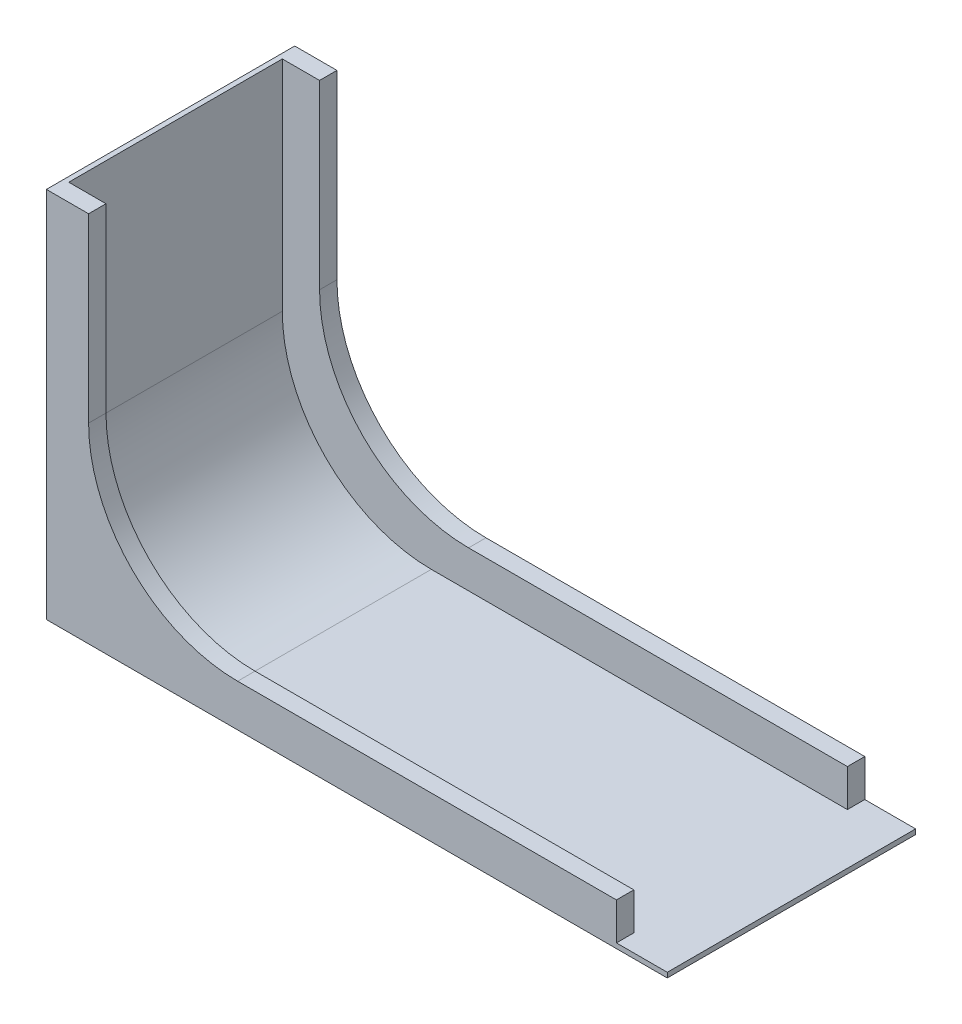
ISO-10303-21;
HEADER;
FILE_DESCRIPTION(('STEP AP214'),'2;1');
FILE_NAME('part.step','',(''),(''),'','','');
FILE_SCHEMA(('AUTOMOTIVE_DESIGN { 1 0 10303 214 1 1 1 1 }'));
ENDSEC;
DATA;
#1=APPLICATION_CONTEXT('core data for automotive mechanical design processes');
#2=APPLICATION_PROTOCOL_DEFINITION('international standard','automotive_design',2000,#1);
#3=PRODUCT_CONTEXT('',#1,'mechanical');
#4=PRODUCT('Part','Part','',(#3));
#5=PRODUCT_RELATED_PRODUCT_CATEGORY('part','',(#4));
#6=PRODUCT_DEFINITION_FORMATION('','',#4);
#7=PRODUCT_DEFINITION_CONTEXT('part definition',#1,'design');
#8=PRODUCT_DEFINITION('design','',#6,#7);
#9=PRODUCT_DEFINITION_SHAPE('','',#8);
#10=(LENGTH_UNIT() NAMED_UNIT(*) SI_UNIT(.MILLI.,.METRE.));
#11=(NAMED_UNIT(*) PLANE_ANGLE_UNIT() SI_UNIT($,.RADIAN.));
#12=(NAMED_UNIT(*) SI_UNIT($,.STERADIAN.) SOLID_ANGLE_UNIT());
#13=UNCERTAINTY_MEASURE_WITH_UNIT(LENGTH_MEASURE(1.E-05),#10,'distance_accuracy_value','');
#14=(GEOMETRIC_REPRESENTATION_CONTEXT(3) GLOBAL_UNCERTAINTY_ASSIGNED_CONTEXT((#13)) GLOBAL_UNIT_ASSIGNED_CONTEXT((#10,
#11,#12)) REPRESENTATION_CONTEXT('',''));
#15=CARTESIAN_POINT('',(0.,0.,0.));
#16=DIRECTION('',(0.,0.,1.));
#17=DIRECTION('',(1.,0.,0.));
#18=AXIS2_PLACEMENT_3D('',#15,#16,#17);
#19=CARTESIAN_POINT('',(-48.2323156450782,148.896265560166,100.));
#20=DIRECTION('',(-1.,0.,0.));
#21=DIRECTION('',(0.,0.,1.));
#22=AXIS2_PLACEMENT_3D('',#19,#20,#21);
#23=PLANE('',#22);
#24=DIRECTION('',(0.,-1.,0.));
#25=VECTOR('',#24,1.);
#26=CARTESIAN_POINT('',(-48.2323156450782,15.896265560166,93.));
#27=LINE('',#26,#25);
#28=CARTESIAN_POINT('',(-48.2323156450782,148.896265560166,93.));
#29=VERTEX_POINT('',#28);
#30=CARTESIAN_POINT('',(-48.2323156450782,60.896265560166,93.));
#31=VERTEX_POINT('',#30);
#32=EDGE_CURVE('E327',#29,#31,#27,.T.);
#33=ORIENTED_EDGE('',*,*,#32,.T.);
#34=DIRECTION('',(0.,0.,-1.));
#35=VECTOR('',#34,1.);
#36=CARTESIAN_POINT('',(-48.2323156450782,60.896265560166,7.00000000000002));
#37=LINE('',#36,#35);
#38=CARTESIAN_POINT('',(-48.2323156450782,60.896265560166,7.00000000000002));
#39=VERTEX_POINT('',#38);
#40=EDGE_CURVE('E167',#31,#39,#37,.T.);
#41=ORIENTED_EDGE('',*,*,#40,.T.);
#42=DIRECTION('',(0.,-1.,0.));
#43=VECTOR('',#42,1.);
#44=CARTESIAN_POINT('',(-48.2323156450782,15.896265560166,7.00000000000002));
#45=LINE('',#44,#43);
#46=CARTESIAN_POINT('',(-48.2323156450782,148.896265560166,7.));
#47=VERTEX_POINT('',#46);
#48=EDGE_CURVE('E160',#47,#39,#45,.T.);
#49=ORIENTED_EDGE('',*,*,#48,.F.);
#50=DIRECTION('',(0.,0.,-1.));
#51=VECTOR('',#50,1.);
#52=CARTESIAN_POINT('',(-48.2323156450782,148.896265560166,100.));
#53=LINE('',#52,#51);
#54=EDGE_CURVE('E164',#29,#47,#53,.T.);
#55=ORIENTED_EDGE('',*,*,#54,.F.);
#56=EDGE_LOOP('',(#33,#41,#49,#55));
#57=FACE_BOUND('',#56,.T.);
#58=ADVANCED_FACE('F41',(#57),#23,.F.);
#59=CARTESIAN_POINT('',(0.,15.896265560166,0.));
#60=DIRECTION('',(0.,1.,0.));
#61=DIRECTION('',(0.,0.,1.));
#62=AXIS2_PLACEMENT_3D('',#59,#60,#61);
#63=PLANE('',#62);
#64=DIRECTION('',(-1.,0.,0.));
#65=VECTOR('',#64,1.);
#66=CARTESIAN_POINT('',(0.,15.896265560166,0.));
#67=LINE('',#66,#65);
#68=CARTESIAN_POINT('',(179.294223463213,15.896265560166,0.));
#69=VERTEX_POINT('',#68);
#70=CARTESIAN_POINT('',(26.7676843549218,15.896265560166,0.));
#71=VERTEX_POINT('',#70);
#72=EDGE_CURVE('E229',#69,#71,#67,.T.);
#73=ORIENTED_EDGE('',*,*,#72,.T.);
#74=DIRECTION('',(0.,0.,-1.));
#75=VECTOR('',#74,1.);
#76=CARTESIAN_POINT('',(26.7676843549218,15.896265560166,0.));
#77=LINE('',#76,#75);
#78=CARTESIAN_POINT('',(26.7676843549218,15.896265560166,7.00000000000002));
#79=VERTEX_POINT('',#78);
#80=EDGE_CURVE('E199',#71,#79,#77,.F.);
#81=ORIENTED_EDGE('',*,*,#80,.T.);
#82=DIRECTION('',(-1.,0.,0.));
#83=VECTOR('',#82,1.);
#84=CARTESIAN_POINT('',(0.,15.896265560166,7.00000000000003));
#85=LINE('',#84,#83);
#86=CARTESIAN_POINT('',(179.294223463213,15.896265560166,7.));
#87=VERTEX_POINT('',#86);
#88=EDGE_CURVE('E213',#87,#79,#85,.T.);
#89=ORIENTED_EDGE('',*,*,#88,.F.);
#90=DIRECTION('',(0.,0.,1.));
#91=VECTOR('',#90,1.);
#92=CARTESIAN_POINT('',(179.294223463213,15.896265560166,0.));
#93=LINE('',#92,#91);
#94=EDGE_CURVE('E235',#69,#87,#93,.T.);
#95=ORIENTED_EDGE('',*,*,#94,.F.);
#96=EDGE_LOOP('',(#73,#81,#89,#95));
#97=FACE_BOUND('',#96,.T.);
#98=ADVANCED_FACE('F233',(#97),#63,.T.);
#99=CARTESIAN_POINT('',(-50.2323156450782,148.896265560166,100.));
#100=DIRECTION('',(0.,-1.,0.));
#101=DIRECTION('',(0.,0.,-1.));
#102=AXIS2_PLACEMENT_3D('',#99,#100,#101);
#103=PLANE('',#102);
#104=DIRECTION('',(-1.,0.,0.));
#105=VECTOR('',#104,1.);
#106=CARTESIAN_POINT('',(-50.2323156450782,148.896265560166,0.));
#107=LINE('',#106,#105);
#108=CARTESIAN_POINT('',(-33.2323156450782,148.896265560166,0.));
#109=VERTEX_POINT('',#108);
#110=CARTESIAN_POINT('',(-50.2323156450782,148.896265560166,0.));
#111=VERTEX_POINT('',#110);
#112=EDGE_CURVE('E249',#109,#111,#107,.T.);
#113=ORIENTED_EDGE('',*,*,#112,.T.);
#114=DIRECTION('',(0.,0.,-1.));
#115=VECTOR('',#114,1.);
#116=CARTESIAN_POINT('',(-50.2323156450782,148.896265560166,100.));
#117=LINE('',#116,#115);
#118=CARTESIAN_POINT('',(-50.2323156450782,148.896265560166,100.));
#119=VERTEX_POINT('',#118);
#120=EDGE_CURVE('E185',#119,#111,#117,.T.);
#121=ORIENTED_EDGE('',*,*,#120,.F.);
#122=DIRECTION('',(-1.,0.,0.));
#123=VECTOR('',#122,1.);
#124=CARTESIAN_POINT('',(-50.2323156450782,148.896265560166,100.));
#125=LINE('',#124,#123);
#126=CARTESIAN_POINT('',(-33.2323156450782,148.896265560166,100.));
#127=VERTEX_POINT('',#126);
#128=EDGE_CURVE('E253',#127,#119,#125,.T.);
#129=ORIENTED_EDGE('',*,*,#128,.F.);
#130=DIRECTION('',(0.,0.,1.));
#131=VECTOR('',#130,1.);
#132=CARTESIAN_POINT('',(-33.2323156450782,148.896265560166,100.));
#133=LINE('',#132,#131);
#134=CARTESIAN_POINT('',(-33.2323156450782,148.896265560166,93.));
#135=VERTEX_POINT('',#134);
#136=EDGE_CURVE('E311',#135,#127,#133,.T.);
#137=ORIENTED_EDGE('',*,*,#136,.F.);
#138=DIRECTION('',(-1.,0.,0.));
#139=VECTOR('',#138,1.);
#140=CARTESIAN_POINT('',(-33.2323156450782,148.896265560166,93.));
#141=LINE('',#140,#139);
#142=EDGE_CURVE('E183',#135,#29,#141,.T.);
#143=ORIENTED_EDGE('',*,*,#142,.T.);
#144=ORIENTED_EDGE('',*,*,#54,.T.);
#145=DIRECTION('',(-1.,0.,0.));
#146=VECTOR('',#145,1.);
#147=CARTESIAN_POINT('',(-33.2323156450782,148.896265560166,7.));
#148=LINE('',#147,#146);
#149=CARTESIAN_POINT('',(-33.2323156450782,148.896265560166,7.));
#150=VERTEX_POINT('',#149);
#151=EDGE_CURVE('E173',#150,#47,#148,.T.);
#152=ORIENTED_EDGE('',*,*,#151,.F.);
#153=DIRECTION('',(0.,0.,1.));
#154=VECTOR('',#153,1.);
#155=CARTESIAN_POINT('',(-33.2323156450782,148.896265560166,0.));
#156=LINE('',#155,#154);
#157=EDGE_CURVE('E220',#109,#150,#156,.T.);
#158=ORIENTED_EDGE('',*,*,#157,.F.);
#159=EDGE_LOOP('',(#113,#121,#129,#137,#143,#144,#152,#158));
#160=FACE_BOUND('',#159,.T.);
#161=ADVANCED_FACE('F180',(#160),#103,.F.);
#162=CARTESIAN_POINT('',(-50.2323156450782,-1.10373443983403,100.));
#163=DIRECTION('',(1.,0.,0.));
#164=DIRECTION('',(0.,0.,-1.));
#165=AXIS2_PLACEMENT_3D('',#162,#163,#164);
#166=PLANE('',#165);
#167=DIRECTION('',(0.,-1.,0.));
#168=VECTOR('',#167,1.);
#169=CARTESIAN_POINT('',(-50.2323156450782,-1.10373443983403,0.));
#170=LINE('',#169,#168);
#171=CARTESIAN_POINT('',(-50.2323156450782,-1.10373443983403,0.));
#172=VERTEX_POINT('',#171);
#173=EDGE_CURVE('E265',#111,#172,#170,.T.);
#174=ORIENTED_EDGE('',*,*,#173,.T.);
#175=DIRECTION('',(0.,0.,-1.));
#176=VECTOR('',#175,1.);
#177=CARTESIAN_POINT('',(-50.2323156450782,-1.10373443983403,100.));
#178=LINE('',#177,#176);
#179=CARTESIAN_POINT('',(-50.2323156450782,-1.10373443983403,100.));
#180=VERTEX_POINT('',#179);
#181=EDGE_CURVE('E191',#180,#172,#178,.T.);
#182=ORIENTED_EDGE('',*,*,#181,.F.);
#183=DIRECTION('',(0.,-1.,0.));
#184=VECTOR('',#183,1.);
#185=CARTESIAN_POINT('',(-50.2323156450782,-1.10373443983403,100.));
#186=LINE('',#185,#184);
#187=EDGE_CURVE('E256',#119,#180,#186,.T.);
#188=ORIENTED_EDGE('',*,*,#187,.F.);
#189=ORIENTED_EDGE('',*,*,#120,.T.);
#190=EDGE_LOOP('',(#174,#182,#188,#189));
#191=FACE_BOUND('',#190,.T.);
#192=ADVANCED_FACE('F285',(#191),#166,.F.);
#193=CARTESIAN_POINT('',(-0.232315645078182,-1.10373443983402,100.));
#194=DIRECTION('',(0.,1.,0.));
#195=DIRECTION('',(0.,0.,1.));
#196=AXIS2_PLACEMENT_3D('',#193,#194,#195);
#197=PLANE('',#196);
#198=DIRECTION('',(1.,0.,0.));
#199=VECTOR('',#198,1.);
#200=CARTESIAN_POINT('',(-0.232315645078182,-1.10373443983402,0.));
#201=LINE('',#200,#199);
#202=CARTESIAN_POINT('',(199.767684354922,-1.10373443983402,0.));
#203=VERTEX_POINT('',#202);
#204=EDGE_CURVE('E268',#172,#203,#201,.T.);
#205=ORIENTED_EDGE('',*,*,#204,.T.);
#206=DIRECTION('',(0.,0.,-1.));
#207=VECTOR('',#206,1.);
#208=CARTESIAN_POINT('',(199.767684354922,-1.10373443983402,100.));
#209=LINE('',#208,#207);
#210=CARTESIAN_POINT('',(199.767684354922,-1.10373443983402,100.));
#211=VERTEX_POINT('',#210);
#212=EDGE_CURVE('E275',#211,#203,#209,.T.);
#213=ORIENTED_EDGE('',*,*,#212,.F.);
#214=DIRECTION('',(1.,0.,0.));
#215=VECTOR('',#214,1.);
#216=CARTESIAN_POINT('',(-0.232315645078182,-1.10373443983402,100.));
#217=LINE('',#216,#215);
#218=EDGE_CURVE('E258',#180,#211,#217,.T.);
#219=ORIENTED_EDGE('',*,*,#218,.F.);
#220=ORIENTED_EDGE('',*,*,#181,.T.);
#221=EDGE_LOOP('',(#205,#213,#219,#220));
#222=FACE_BOUND('',#221,.T.);
#223=ADVANCED_FACE('F281',(#222),#197,.F.);
#224=CARTESIAN_POINT('',(199.767684354922,0.896265560165975,100.));
#225=DIRECTION('',(-1.,0.,0.));
#226=DIRECTION('',(0.,0.,1.));
#227=AXIS2_PLACEMENT_3D('',#224,#225,#226);
#228=PLANE('',#227);
#229=DIRECTION('',(0.,1.,0.));
#230=VECTOR('',#229,1.);
#231=CARTESIAN_POINT('',(199.767684354922,0.896265560165975,0.));
#232=LINE('',#231,#230);
#233=CARTESIAN_POINT('',(199.767684354922,0.896265560165975,0.));
#234=VERTEX_POINT('',#233);
#235=EDGE_CURVE('E270',#203,#234,#232,.T.);
#236=ORIENTED_EDGE('',*,*,#235,.T.);
#237=DIRECTION('',(0.,0.,-1.));
#238=VECTOR('',#237,1.);
#239=CARTESIAN_POINT('',(199.767684354922,0.896265560165975,100.));
#240=LINE('',#239,#238);
#241=CARTESIAN_POINT('',(199.767684354922,0.896265560165975,100.));
#242=VERTEX_POINT('',#241);
#243=EDGE_CURVE('E263',#242,#234,#240,.T.);
#244=ORIENTED_EDGE('',*,*,#243,.F.);
#245=DIRECTION('',(0.,1.,0.));
#246=VECTOR('',#245,1.);
#247=CARTESIAN_POINT('',(199.767684354922,0.896265560165975,100.));
#248=LINE('',#247,#246);
#249=EDGE_CURVE('E260',#211,#242,#248,.T.);
#250=ORIENTED_EDGE('',*,*,#249,.F.);
#251=ORIENTED_EDGE('',*,*,#212,.T.);
#252=EDGE_LOOP('',(#236,#244,#250,#251));
#253=FACE_BOUND('',#252,.T.);
#254=ADVANCED_FACE('F292',(#253),#228,.F.);
#255=CARTESIAN_POINT('',(-0.232315645078196,0.896265560165975,100.));
#256=DIRECTION('',(0.,-1.,0.));
#257=DIRECTION('',(0.,0.,-1.));
#258=AXIS2_PLACEMENT_3D('',#255,#256,#257);
#259=PLANE('',#258);
#260=DIRECTION('',(-1.,0.,0.));
#261=VECTOR('',#260,1.);
#262=CARTESIAN_POINT('',(0.,0.896265560165975,7.00000000000003));
#263=LINE('',#262,#261);
#264=CARTESIAN_POINT('',(179.294223463213,0.896265560165975,7.00000000000001));
#265=VERTEX_POINT('',#264);
#266=CARTESIAN_POINT('',(11.7676843549218,0.896265560165975,7.00000000000002));
#267=VERTEX_POINT('',#266);
#268=EDGE_CURVE('E238',#265,#267,#263,.T.);
#269=ORIENTED_EDGE('',*,*,#268,.T.);
#270=DIRECTION('',(0.,0.,-1.));
#271=VECTOR('',#270,1.);
#272=CARTESIAN_POINT('',(11.7676843549218,0.896265560165975,93.));
#273=LINE('',#272,#271);
#274=CARTESIAN_POINT('',(11.7676843549218,0.896265560165975,93.));
#275=VERTEX_POINT('',#274);
#276=EDGE_CURVE('E62',#267,#275,#273,.F.);
#277=ORIENTED_EDGE('',*,*,#276,.T.);
#278=DIRECTION('',(-1.,0.,0.));
#279=VECTOR('',#278,1.);
#280=CARTESIAN_POINT('',(0.,0.896265560165975,93.));
#281=LINE('',#280,#279);
#282=CARTESIAN_POINT('',(179.294223463213,0.896265560165975,93.));
#283=VERTEX_POINT('',#282);
#284=EDGE_CURVE('E318',#283,#275,#281,.T.);
#285=ORIENTED_EDGE('',*,*,#284,.F.);
#286=DIRECTION('',(0.,0.,1.));
#287=VECTOR('',#286,1.);
#288=CARTESIAN_POINT('',(179.294223463213,0.896265560165975,0.));
#289=LINE('',#288,#287);
#290=CARTESIAN_POINT('',(179.294223463213,0.896265560165975,100.));
#291=VERTEX_POINT('',#290);
#292=EDGE_CURVE('E297',#283,#291,#289,.T.);
#293=ORIENTED_EDGE('',*,*,#292,.T.);
#294=DIRECTION('',(-1.,0.,0.));
#295=VECTOR('',#294,1.);
#296=CARTESIAN_POINT('',(-3.2937496879602,0.896265560165975,100.));
#297=LINE('',#296,#295);
#298=EDGE_CURVE('E250',#242,#291,#297,.T.);
#299=ORIENTED_EDGE('',*,*,#298,.F.);
#300=ORIENTED_EDGE('',*,*,#243,.T.);
#301=DIRECTION('',(-1.,0.,0.));
#302=VECTOR('',#301,1.);
#303=CARTESIAN_POINT('',(-0.232315645078196,0.896265560165975,0.));
#304=LINE('',#303,#302);
#305=CARTESIAN_POINT('',(179.294223463213,0.896265560165975,0.));
#306=VERTEX_POINT('',#305);
#307=EDGE_CURVE('E254',#234,#306,#304,.T.);
#308=ORIENTED_EDGE('',*,*,#307,.T.);
#309=DIRECTION('',(0.,0.,1.));
#310=VECTOR('',#309,1.);
#311=CARTESIAN_POINT('',(179.294223463213,0.896265560165975,0.));
#312=LINE('',#311,#310);
#313=EDGE_CURVE('E242',#306,#265,#312,.T.);
#314=ORIENTED_EDGE('',*,*,#313,.T.);
#315=EDGE_LOOP('',(#269,#277,#285,#293,#299,#300,#308,#314));
#316=FACE_BOUND('',#315,.T.);
#317=ADVANCED_FACE('F294',(#316),#259,.F.);
#318=CARTESIAN_POINT('',(0.,0.,100.));
#319=DIRECTION('',(0.,0.,-1.));
#320=DIRECTION('',(-1.,0.,0.));
#321=AXIS2_PLACEMENT_3D('',#318,#319,#320);
#322=PLANE('',#321);
#323=DIRECTION('',(0.,-1.,0.));
#324=VECTOR('',#323,1.);
#325=CARTESIAN_POINT('',(-33.2323156450782,148.896265560166,100.));
#326=LINE('',#325,#324);
#327=CARTESIAN_POINT('',(-33.2323156450782,75.896265560166,100.));
#328=VERTEX_POINT('',#327);
#329=EDGE_CURVE('E303',#127,#328,#326,.T.);
#330=ORIENTED_EDGE('',*,*,#329,.F.);
#331=ORIENTED_EDGE('',*,*,#128,.T.);
#332=ORIENTED_EDGE('',*,*,#187,.T.);
#333=ORIENTED_EDGE('',*,*,#218,.T.);
#334=ORIENTED_EDGE('',*,*,#249,.T.);
#335=ORIENTED_EDGE('',*,*,#298,.T.);
#336=DIRECTION('',(0.,-1.,0.));
#337=VECTOR('',#336,1.);
#338=CARTESIAN_POINT('',(179.294223463213,15.896265560166,100.));
#339=LINE('',#338,#337);
#340=CARTESIAN_POINT('',(179.294223463213,15.896265560166,100.));
#341=VERTEX_POINT('',#340);
#342=EDGE_CURVE('E323',#341,#291,#339,.T.);
#343=ORIENTED_EDGE('',*,*,#342,.F.);
#344=DIRECTION('',(1.,0.,0.));
#345=VECTOR('',#344,1.);
#346=CARTESIAN_POINT('',(0.,15.896265560166,100.));
#347=LINE('',#346,#345);
#348=CARTESIAN_POINT('',(26.7676843549218,15.896265560166,100.));
#349=VERTEX_POINT('',#348);
#350=EDGE_CURVE('E321',#349,#341,#347,.T.);
#351=ORIENTED_EDGE('',*,*,#350,.F.);
#352=CARTESIAN_POINT('',(26.7676843549218,75.896265560166,100.));
#353=DIRECTION('',(0.,0.,-1.));
#354=DIRECTION('',(-1.,0.,0.));
#355=AXIS2_PLACEMENT_3D('',#352,#353,#354);
#356=CIRCLE('',#355,60.);
#357=EDGE_CURVE('E205',#349,#328,#356,.T.);
#358=ORIENTED_EDGE('',*,*,#357,.T.);
#359=EDGE_LOOP('',(#330,#331,#332,#333,#334,#335,#343,#351,#358));
#360=FACE_BOUND('',#359,.T.);
#361=ADVANCED_FACE('F301',(#360),#322,.F.);
#362=CARTESIAN_POINT('',(0.,0.,0.));
#363=DIRECTION('',(0.,0.,-1.));
#364=DIRECTION('',(-1.,0.,0.));
#365=AXIS2_PLACEMENT_3D('',#362,#363,#364);
#366=PLANE('',#365);
#367=ORIENTED_EDGE('',*,*,#112,.F.);
#368=DIRECTION('',(0.,1.,0.));
#369=VECTOR('',#368,1.);
#370=CARTESIAN_POINT('',(-33.2323156450782,148.896265560166,0.));
#371=LINE('',#370,#369);
#372=CARTESIAN_POINT('',(-33.2323156450782,75.896265560166,0.));
#373=VERTEX_POINT('',#372);
#374=EDGE_CURVE('E231',#373,#109,#371,.T.);
#375=ORIENTED_EDGE('',*,*,#374,.F.);
#376=CARTESIAN_POINT('',(26.7676843549218,75.896265560166,0.));
#377=DIRECTION('',(0.,0.,-1.));
#378=DIRECTION('',(-1.,0.,0.));
#379=AXIS2_PLACEMENT_3D('',#376,#377,#378);
#380=CIRCLE('',#379,60.);
#381=EDGE_CURVE('E207',#373,#71,#380,.F.);
#382=ORIENTED_EDGE('',*,*,#381,.T.);
#383=ORIENTED_EDGE('',*,*,#72,.F.);
#384=DIRECTION('',(0.,-1.,0.));
#385=VECTOR('',#384,1.);
#386=CARTESIAN_POINT('',(179.294223463213,15.896265560166,0.));
#387=LINE('',#386,#385);
#388=EDGE_CURVE('E168',#69,#306,#387,.T.);
#389=ORIENTED_EDGE('',*,*,#388,.T.);
#390=ORIENTED_EDGE('',*,*,#307,.F.);
#391=ORIENTED_EDGE('',*,*,#235,.F.);
#392=ORIENTED_EDGE('',*,*,#204,.F.);
#393=ORIENTED_EDGE('',*,*,#173,.F.);
#394=EDGE_LOOP('',(#367,#375,#382,#383,#389,#390,#391,#392,#393));
#395=FACE_BOUND('',#394,.T.);
#396=ADVANCED_FACE('F227',(#395),#366,.T.);
#397=CARTESIAN_POINT('',(179.294223463213,15.896265560166,0.));
#398=DIRECTION('',(1.,0.,0.));
#399=DIRECTION('',(0.,0.,-1.));
#400=AXIS2_PLACEMENT_3D('',#397,#398,#399);
#401=PLANE('',#400);
#402=ORIENTED_EDGE('',*,*,#313,.F.);
#403=ORIENTED_EDGE('',*,*,#388,.F.);
#404=ORIENTED_EDGE('',*,*,#94,.T.);
#405=DIRECTION('',(0.,-1.,0.));
#406=VECTOR('',#405,1.);
#407=CARTESIAN_POINT('',(179.294223463213,15.896265560166,7.));
#408=LINE('',#407,#406);
#409=EDGE_CURVE('E169',#87,#265,#408,.T.);
#410=ORIENTED_EDGE('',*,*,#409,.T.);
#411=EDGE_LOOP('',(#402,#403,#404,#410));
#412=FACE_BOUND('',#411,.T.);
#413=ADVANCED_FACE('F379',(#412),#401,.T.);
#414=CARTESIAN_POINT('',(0.,15.896265560166,7.00000000000003));
#415=DIRECTION('',(0.,0.,1.));
#416=DIRECTION('',(1.,0.,0.));
#417=AXIS2_PLACEMENT_3D('',#414,#415,#416);
#418=PLANE('',#417);
#419=ORIENTED_EDGE('',*,*,#48,.T.);
#420=CARTESIAN_POINT('',(11.7676843549218,60.896265560166,7.00000000000003));
#421=DIRECTION('',(0.,0.,1.));
#422=DIRECTION('',(1.,0.,0.));
#423=AXIS2_PLACEMENT_3D('',#420,#421,#422);
#424=CIRCLE('',#423,60.);
#425=EDGE_CURVE('E49',#39,#267,#424,.T.);
#426=ORIENTED_EDGE('',*,*,#425,.T.);
#427=ORIENTED_EDGE('',*,*,#268,.F.);
#428=ORIENTED_EDGE('',*,*,#409,.F.);
#429=ORIENTED_EDGE('',*,*,#88,.T.);
#430=CARTESIAN_POINT('',(26.7676843549218,75.896265560166,7.00000000000002));
#431=DIRECTION('',(0.,0.,1.));
#432=DIRECTION('',(1.,0.,0.));
#433=AXIS2_PLACEMENT_3D('',#430,#431,#432);
#434=CIRCLE('',#433,60.);
#435=CARTESIAN_POINT('',(-33.2323156450782,75.896265560166,7.));
#436=VERTEX_POINT('',#435);
#437=EDGE_CURVE('E209',#79,#436,#434,.F.);
#438=ORIENTED_EDGE('',*,*,#437,.T.);
#439=DIRECTION('',(0.,-1.,0.));
#440=VECTOR('',#439,1.);
#441=CARTESIAN_POINT('',(-33.2323156450782,148.896265560166,7.));
#442=LINE('',#441,#440);
#443=EDGE_CURVE('E176',#150,#436,#442,.T.);
#444=ORIENTED_EDGE('',*,*,#443,.F.);
#445=ORIENTED_EDGE('',*,*,#151,.T.);
#446=EDGE_LOOP('',(#419,#426,#427,#428,#429,#438,#444,#445));
#447=FACE_BOUND('',#446,.T.);
#448=ADVANCED_FACE('F174',(#447),#418,.T.);
#449=CARTESIAN_POINT('',(179.294223463213,15.896265560166,0.));
#450=DIRECTION('',(1.,0.,0.));
#451=DIRECTION('',(0.,0.,-1.));
#452=AXIS2_PLACEMENT_3D('',#449,#450,#451);
#453=PLANE('',#452);
#454=ORIENTED_EDGE('',*,*,#292,.F.);
#455=DIRECTION('',(0.,-1.,0.));
#456=VECTOR('',#455,1.);
#457=CARTESIAN_POINT('',(179.294223463213,15.896265560166,93.));
#458=LINE('',#457,#456);
#459=CARTESIAN_POINT('',(179.294223463213,15.896265560166,93.));
#460=VERTEX_POINT('',#459);
#461=EDGE_CURVE('E244',#460,#283,#458,.T.);
#462=ORIENTED_EDGE('',*,*,#461,.F.);
#463=DIRECTION('',(0.,0.,1.));
#464=VECTOR('',#463,1.);
#465=CARTESIAN_POINT('',(179.294223463213,15.896265560166,0.));
#466=LINE('',#465,#464);
#467=EDGE_CURVE('E314',#460,#341,#466,.T.);
#468=ORIENTED_EDGE('',*,*,#467,.T.);
#469=ORIENTED_EDGE('',*,*,#342,.T.);
#470=EDGE_LOOP('',(#454,#462,#468,#469));
#471=FACE_BOUND('',#470,.T.);
#472=ADVANCED_FACE('F334',(#471),#453,.T.);
#473=CARTESIAN_POINT('',(0.,15.896265560166,93.));
#474=DIRECTION('',(0.,0.,1.));
#475=DIRECTION('',(1.,0.,0.));
#476=AXIS2_PLACEMENT_3D('',#473,#474,#475);
#477=PLANE('',#476);
#478=ORIENTED_EDGE('',*,*,#284,.T.);
#479=CARTESIAN_POINT('',(11.7676843549218,60.896265560166,93.));
#480=DIRECTION('',(0.,0.,1.));
#481=DIRECTION('',(1.,0.,0.));
#482=AXIS2_PLACEMENT_3D('',#479,#480,#481);
#483=CIRCLE('',#482,60.);
#484=EDGE_CURVE('E11',#275,#31,#483,.F.);
#485=ORIENTED_EDGE('',*,*,#484,.T.);
#486=ORIENTED_EDGE('',*,*,#32,.F.);
#487=ORIENTED_EDGE('',*,*,#142,.F.);
#488=DIRECTION('',(0.,1.,0.));
#489=VECTOR('',#488,1.);
#490=CARTESIAN_POINT('',(-33.2323156450782,148.896265560166,93.));
#491=LINE('',#490,#489);
#492=CARTESIAN_POINT('',(-33.2323156450782,75.896265560166,93.));
#493=VERTEX_POINT('',#492);
#494=EDGE_CURVE('E309',#493,#135,#491,.T.);
#495=ORIENTED_EDGE('',*,*,#494,.F.);
#496=CARTESIAN_POINT('',(26.7676843549218,75.896265560166,93.));
#497=DIRECTION('',(0.,0.,1.));
#498=DIRECTION('',(1.,0.,0.));
#499=AXIS2_PLACEMENT_3D('',#496,#497,#498);
#500=CIRCLE('',#499,60.);
#501=CARTESIAN_POINT('',(26.7676843549218,15.896265560166,93.));
#502=VERTEX_POINT('',#501);
#503=EDGE_CURVE('E203',#493,#502,#500,.T.);
#504=ORIENTED_EDGE('',*,*,#503,.T.);
#505=DIRECTION('',(-1.,0.,0.));
#506=VECTOR('',#505,1.);
#507=CARTESIAN_POINT('',(0.,15.896265560166,93.));
#508=LINE('',#507,#506);
#509=EDGE_CURVE('E317',#460,#502,#508,.T.);
#510=ORIENTED_EDGE('',*,*,#509,.F.);
#511=ORIENTED_EDGE('',*,*,#461,.T.);
#512=EDGE_LOOP('',(#478,#485,#486,#487,#495,#504,#510,#511));
#513=FACE_BOUND('',#512,.T.);
#514=ADVANCED_FACE('F330',(#513),#477,.F.);
#515=CARTESIAN_POINT('',(0.,15.896265560166,0.));
#516=DIRECTION('',(0.,1.,0.));
#517=DIRECTION('',(0.,0.,1.));
#518=AXIS2_PLACEMENT_3D('',#515,#516,#517);
#519=PLANE('',#518);
#520=ORIENTED_EDGE('',*,*,#509,.T.);
#521=DIRECTION('',(0.,0.,-1.));
#522=VECTOR('',#521,1.);
#523=CARTESIAN_POINT('',(26.7676843549218,15.896265560166,100.));
#524=LINE('',#523,#522);
#525=EDGE_CURVE('E188',#502,#349,#524,.F.);
#526=ORIENTED_EDGE('',*,*,#525,.T.);
#527=ORIENTED_EDGE('',*,*,#350,.T.);
#528=ORIENTED_EDGE('',*,*,#467,.F.);
#529=EDGE_LOOP('',(#520,#526,#527,#528));
#530=FACE_BOUND('',#529,.T.);
#531=ADVANCED_FACE('F368',(#530),#519,.T.);
#532=CARTESIAN_POINT('',(-33.2323156450782,0.,0.));
#533=DIRECTION('',(1.,0.,0.));
#534=DIRECTION('',(0.,0.,-1.));
#535=AXIS2_PLACEMENT_3D('',#532,#533,#534);
#536=PLANE('',#535);
#537=ORIENTED_EDGE('',*,*,#329,.T.);
#538=DIRECTION('',(0.,0.,-1.));
#539=VECTOR('',#538,1.);
#540=CARTESIAN_POINT('',(-33.2323156450782,75.896265560166,93.));
#541=LINE('',#540,#539);
#542=EDGE_CURVE('E184',#328,#493,#541,.T.);
#543=ORIENTED_EDGE('',*,*,#542,.T.);
#544=ORIENTED_EDGE('',*,*,#494,.T.);
#545=ORIENTED_EDGE('',*,*,#136,.T.);
#546=EDGE_LOOP('',(#537,#543,#544,#545));
#547=FACE_BOUND('',#546,.T.);
#548=ADVANCED_FACE('F344',(#547),#536,.T.);
#549=CARTESIAN_POINT('',(-33.2323156450782,0.,0.));
#550=DIRECTION('',(-1.,0.,0.));
#551=DIRECTION('',(0.,0.,1.));
#552=AXIS2_PLACEMENT_3D('',#549,#550,#551);
#553=PLANE('',#552);
#554=ORIENTED_EDGE('',*,*,#443,.T.);
#555=DIRECTION('',(0.,0.,-1.));
#556=VECTOR('',#555,1.);
#557=CARTESIAN_POINT('',(-33.2323156450782,75.896265560166,0.));
#558=LINE('',#557,#556);
#559=EDGE_CURVE('E196',#436,#373,#558,.T.);
#560=ORIENTED_EDGE('',*,*,#559,.T.);
#561=ORIENTED_EDGE('',*,*,#374,.T.);
#562=ORIENTED_EDGE('',*,*,#157,.T.);
#563=EDGE_LOOP('',(#554,#560,#561,#562));
#564=FACE_BOUND('',#563,.T.);
#565=ADVANCED_FACE('F218',(#564),#553,.F.);
#566=CARTESIAN_POINT('',(26.7676843549218,75.896265560166,0.));
#567=DIRECTION('',(0.,0.,1.));
#568=DIRECTION('',(1.,0.,0.));
#569=AXIS2_PLACEMENT_3D('',#566,#567,#568);
#570=CYLINDRICAL_SURFACE('',#569,60.);
#571=ORIENTED_EDGE('',*,*,#357,.F.);
#572=ORIENTED_EDGE('',*,*,#525,.F.);
#573=ORIENTED_EDGE('',*,*,#503,.F.);
#574=ORIENTED_EDGE('',*,*,#542,.F.);
#575=EDGE_LOOP('',(#571,#572,#573,#574));
#576=FACE_BOUND('',#575,.T.);
#577=ADVANCED_FACE('F341',(#576),#570,.F.);
#578=CARTESIAN_POINT('',(26.7676843549218,75.896265560166,0.));
#579=DIRECTION('',(0.,0.,-1.));
#580=DIRECTION('',(-1.,0.,0.));
#581=AXIS2_PLACEMENT_3D('',#578,#579,#580);
#582=CYLINDRICAL_SURFACE('',#581,60.);
#583=ORIENTED_EDGE('',*,*,#437,.F.);
#584=ORIENTED_EDGE('',*,*,#80,.F.);
#585=ORIENTED_EDGE('',*,*,#381,.F.);
#586=ORIENTED_EDGE('',*,*,#559,.F.);
#587=EDGE_LOOP('',(#583,#584,#585,#586));
#588=FACE_BOUND('',#587,.T.);
#589=ADVANCED_FACE('F222',(#588),#582,.F.);
#590=CARTESIAN_POINT('',(11.7676843549218,60.896265560166,100.));
#591=DIRECTION('',(0.,0.,1.));
#592=DIRECTION('',(1.,0.,0.));
#593=AXIS2_PLACEMENT_3D('',#590,#591,#592);
#594=CYLINDRICAL_SURFACE('',#593,60.);
#595=ORIENTED_EDGE('',*,*,#484,.F.);
#596=ORIENTED_EDGE('',*,*,#276,.F.);
#597=ORIENTED_EDGE('',*,*,#425,.F.);
#598=ORIENTED_EDGE('',*,*,#40,.F.);
#599=EDGE_LOOP('',(#595,#596,#597,#598));
#600=FACE_BOUND('',#599,.T.);
#601=ADVANCED_FACE('F43',(#600),#594,.F.);
#602=CLOSED_SHELL('',(#58,#98,#161,#192,#223,#254,#317,#361,#396,#413,#448,#472,#514,#531,#548,
#565,#577,#589,#601));
#603=MANIFOLD_SOLID_BREP('B2',#602);
#604=ADVANCED_BREP_SHAPE_REPRESENTATION('',(#18,#603),#14);
#605=SHAPE_DEFINITION_REPRESENTATION(#9,#604);
ENDSEC;
END-ISO-10303-21;
